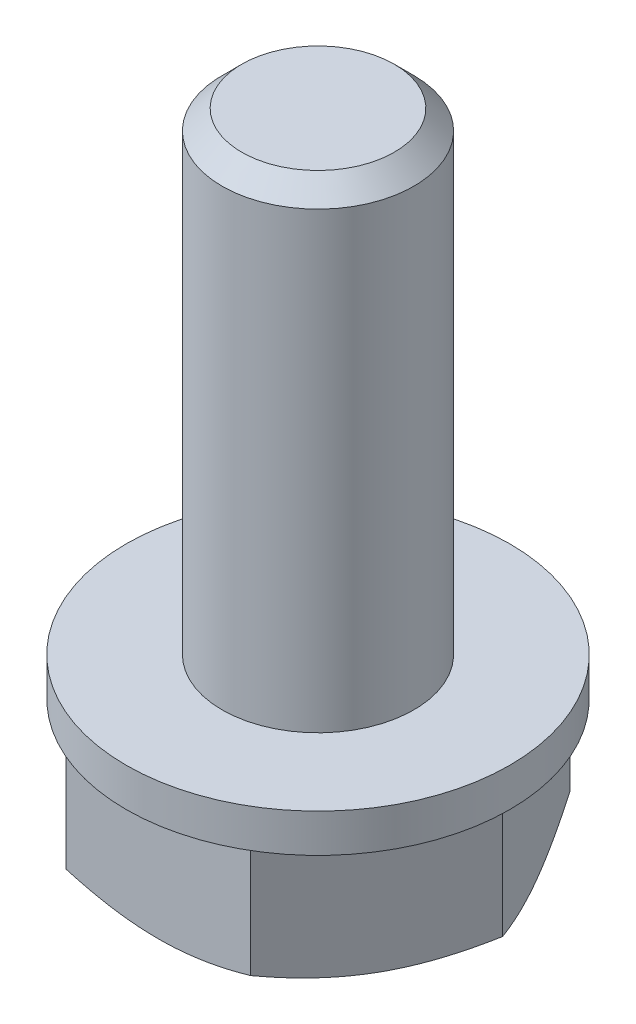
ISO-10303-21;
HEADER;
FILE_DESCRIPTION(('STEP AP214'),'2;1');
FILE_NAME('part.step','',(''),(''),'','','');
FILE_SCHEMA(('AUTOMOTIVE_DESIGN { 1 0 10303 214 1 1 1 1 }'));
ENDSEC;
DATA;
#1=APPLICATION_CONTEXT('core data for automotive mechanical design processes');
#2=APPLICATION_PROTOCOL_DEFINITION('international standard','automotive_design',2000,#1);
#3=PRODUCT_CONTEXT('',#1,'mechanical');
#4=PRODUCT('Part','Part','',(#3));
#5=PRODUCT_RELATED_PRODUCT_CATEGORY('part','',(#4));
#6=PRODUCT_DEFINITION_FORMATION('','',#4);
#7=PRODUCT_DEFINITION_CONTEXT('part definition',#1,'design');
#8=PRODUCT_DEFINITION('design','',#6,#7);
#9=PRODUCT_DEFINITION_SHAPE('','',#8);
#10=(LENGTH_UNIT() NAMED_UNIT(*) SI_UNIT(.MILLI.,.METRE.));
#11=(NAMED_UNIT(*) PLANE_ANGLE_UNIT() SI_UNIT($,.RADIAN.));
#12=(NAMED_UNIT(*) SI_UNIT($,.STERADIAN.) SOLID_ANGLE_UNIT());
#13=UNCERTAINTY_MEASURE_WITH_UNIT(LENGTH_MEASURE(1.E-05),#10,'distance_accuracy_value','');
#14=(GEOMETRIC_REPRESENTATION_CONTEXT(3) GLOBAL_UNCERTAINTY_ASSIGNED_CONTEXT((#13)) GLOBAL_UNIT_ASSIGNED_CONTEXT((#10,
#11,#12)) REPRESENTATION_CONTEXT('',''));
#15=CARTESIAN_POINT('',(0.,0.,0.));
#16=DIRECTION('',(0.,0.,1.));
#17=DIRECTION('',(1.,0.,0.));
#18=AXIS2_PLACEMENT_3D('',#15,#16,#17);
#19=CARTESIAN_POINT('',(-17.677669529664,-54.8,-20.177669529664));
#20=DIRECTION('',(0.,-1.,0.));
#21=DIRECTION('',(0.,0.,-1.));
#22=AXIS2_PLACEMENT_3D('',#19,#20,#21);
#23=PLANE('',#22);
#24=CARTESIAN_POINT('',(-17.677669529664,-54.8,-17.677669529664));
#25=DIRECTION('',(0.,-1.,0.));
#26=DIRECTION('',(0.,0.,-1.));
#27=AXIS2_PLACEMENT_3D('',#24,#25,#26);
#28=CIRCLE('',#27,5.);
#29=CARTESIAN_POINT('',(-17.677669529664,-54.8,-22.677669529664));
#30=VERTEX_POINT('',#29);
#31=CARTESIAN_POINT('',(-13.3475425107418,-54.8,-20.1776695296641));
#32=VERTEX_POINT('',#31);
#33=EDGE_CURVE('E100',#30,#32,#28,.T.);
#34=ORIENTED_EDGE('',*,*,#33,.T.);
#35=CARTESIAN_POINT('',(-17.677669529664,-54.8,-17.677669529664));
#36=DIRECTION('',(0.,-1.,0.));
#37=DIRECTION('',(0.,0.,-1.));
#38=AXIS2_PLACEMENT_3D('',#35,#36,#37);
#39=CIRCLE('',#38,5.);
#40=CARTESIAN_POINT('',(-13.3475425107418,-54.8,-15.1776695296639));
#41=VERTEX_POINT('',#40);
#42=EDGE_CURVE('E67',#32,#41,#39,.T.);
#43=ORIENTED_EDGE('',*,*,#42,.T.);
#44=CARTESIAN_POINT('',(-17.677669529664,-54.8,-17.677669529664));
#45=DIRECTION('',(0.,-1.,0.));
#46=DIRECTION('',(0.,0.,-1.));
#47=AXIS2_PLACEMENT_3D('',#44,#45,#46);
#48=CIRCLE('',#47,5.);
#49=CARTESIAN_POINT('',(-17.677669529664,-54.8,-12.677669529664));
#50=VERTEX_POINT('',#49);
#51=EDGE_CURVE('E171',#41,#50,#48,.T.);
#52=ORIENTED_EDGE('',*,*,#51,.T.);
#53=CARTESIAN_POINT('',(-17.677669529664,-54.8,-17.677669529664));
#54=DIRECTION('',(0.,-1.,0.));
#55=DIRECTION('',(0.,0.,-1.));
#56=AXIS2_PLACEMENT_3D('',#53,#54,#55);
#57=CIRCLE('',#56,5.);
#58=CARTESIAN_POINT('',(-22.0077965485861,-54.8,-15.1776695296639));
#59=VERTEX_POINT('',#58);
#60=EDGE_CURVE('E191',#50,#59,#57,.T.);
#61=ORIENTED_EDGE('',*,*,#60,.T.);
#62=CARTESIAN_POINT('',(-17.677669529664,-54.8,-17.677669529664));
#63=DIRECTION('',(0.,-1.,0.));
#64=DIRECTION('',(0.,0.,-1.));
#65=AXIS2_PLACEMENT_3D('',#62,#63,#64);
#66=CIRCLE('',#65,5.);
#67=CARTESIAN_POINT('',(-22.0077965485861,-54.8,-20.1776695296641));
#68=VERTEX_POINT('',#67);
#69=EDGE_CURVE('E120',#59,#68,#66,.T.);
#70=ORIENTED_EDGE('',*,*,#69,.T.);
#71=CARTESIAN_POINT('',(-17.677669529664,-54.8,-17.677669529664));
#72=DIRECTION('',(0.,-1.,0.));
#73=DIRECTION('',(0.,0.,-1.));
#74=AXIS2_PLACEMENT_3D('',#71,#72,#73);
#75=CIRCLE('',#74,5.);
#76=EDGE_CURVE('E108',#68,#30,#75,.T.);
#77=ORIENTED_EDGE('',*,*,#76,.T.);
#78=EDGE_LOOP('',(#34,#43,#52,#61,#70,#77));
#79=FACE_BOUND('',#78,.T.);
#80=ADVANCED_FACE('F16',(#79),#23,.T.);
#81=CARTESIAN_POINT('',(-17.677669529664,-51.9113248654052,-17.677669529664));
#82=DIRECTION('',(0.,1.,0.));
#83=DIRECTION('',(0.,0.,-1.));
#84=AXIS2_PLACEMENT_3D('',#81,#82,#83);
#85=CYLINDRICAL_SURFACE('',#84,6.);
#86=CARTESIAN_POINT('',(-17.677669529664,-49.6,-17.677669529664));
#87=DIRECTION('',(0.,-1.,0.));
#88=DIRECTION('',(0.,0.,-1.));
#89=AXIS2_PLACEMENT_3D('',#86,#87,#88);
#90=CIRCLE('',#89,6.);
#91=CARTESIAN_POINT('',(-17.677669529664,-49.6,-23.677669529664));
#92=VERTEX_POINT('',#91);
#93=EDGE_CURVE('E11',#92,#92,#90,.T.);
#94=ORIENTED_EDGE('',*,*,#93,.T.);
#95=EDGE_LOOP('',(#94));
#96=FACE_BOUND('',#95,.T.);
#97=CARTESIAN_POINT('',(-17.677669529664,-50.8,-17.677669529664));
#98=DIRECTION('',(0.,1.,0.));
#99=DIRECTION('',(0.,0.,-1.));
#100=AXIS2_PLACEMENT_3D('',#97,#98,#99);
#101=CIRCLE('',#100,6.);
#102=CARTESIAN_POINT('',(-17.677669529664,-50.8,-23.677669529664));
#103=VERTEX_POINT('',#102);
#104=EDGE_CURVE('E172',#103,#103,#101,.T.);
#105=ORIENTED_EDGE('',*,*,#104,.T.);
#106=EDGE_LOOP('',(#105));
#107=FACE_BOUND('',#106,.T.);
#108=ADVANCED_FACE('F293',(#96,#107),#85,.T.);
#109=CARTESIAN_POINT('',(-17.677669529664,-49.6,-22.177669529664));
#110=DIRECTION('',(0.,1.,0.));
#111=DIRECTION('',(0.,0.,1.));
#112=AXIS2_PLACEMENT_3D('',#109,#110,#111);
#113=PLANE('',#112);
#114=CARTESIAN_POINT('',(-17.677669529664,-49.6,-17.677669529664));
#115=DIRECTION('',(0.,-1.,0.));
#116=DIRECTION('',(0.,0.,-1.));
#117=AXIS2_PLACEMENT_3D('',#114,#115,#116);
#118=CIRCLE('',#117,3.);
#119=CARTESIAN_POINT('',(-17.677669529664,-49.6,-20.677669529664));
#120=VERTEX_POINT('',#119);
#121=EDGE_CURVE('E26',#120,#120,#118,.T.);
#122=ORIENTED_EDGE('',*,*,#121,.T.);
#123=EDGE_LOOP('',(#122));
#124=FACE_BOUND('',#123,.T.);
#125=ORIENTED_EDGE('',*,*,#93,.F.);
#126=EDGE_LOOP('',(#125));
#127=FACE_BOUND('',#126,.T.);
#128=ADVANCED_FACE('F298',(#124,#127),#113,.T.);
#129=CARTESIAN_POINT('',(-17.677669529664,-42.50675,-17.677669529664));
#130=DIRECTION('',(0.,1.,0.));
#131=DIRECTION('',(0.,0.,-1.));
#132=AXIS2_PLACEMENT_3D('',#129,#130,#131);
#133=CYLINDRICAL_SURFACE('',#132,3.);
#134=CARTESIAN_POINT('',(-17.677669529664,-35.4135,-17.677669529664));
#135=DIRECTION('',(0.,-1.,0.));
#136=DIRECTION('',(0.,0.,-1.));
#137=AXIS2_PLACEMENT_3D('',#134,#135,#136);
#138=CIRCLE('',#137,3.);
#139=CARTESIAN_POINT('',(-17.677669529664,-35.4135,-20.677669529664));
#140=VERTEX_POINT('',#139);
#141=EDGE_CURVE('E193',#140,#140,#138,.T.);
#142=ORIENTED_EDGE('',*,*,#141,.T.);
#143=EDGE_LOOP('',(#142));
#144=FACE_BOUND('',#143,.T.);
#145=ORIENTED_EDGE('',*,*,#121,.F.);
#146=EDGE_LOOP('',(#145));
#147=FACE_BOUND('',#146,.T.);
#148=ADVANCED_FACE('F319',(#144,#147),#133,.T.);
#149=CARTESIAN_POINT('',(-17.677669529664,-35.10675,-17.677669529664));
#150=DIRECTION('',(0.,-1.,0.));
#151=DIRECTION('',(0.,0.,-1.));
#152=AXIS2_PLACEMENT_3D('',#149,#150,#151);
#153=CONICAL_SURFACE('',#152,2.69325,0.785398163397448);
#154=CARTESIAN_POINT('',(-17.677669529664,-34.8,-17.677669529664));
#155=DIRECTION('',(0.,-1.,0.));
#156=DIRECTION('',(0.,0.,-1.));
#157=AXIS2_PLACEMENT_3D('',#154,#155,#156);
#158=CIRCLE('',#157,2.3865);
#159=CARTESIAN_POINT('',(-17.677669529664,-34.8,-20.064169529664));
#160=VERTEX_POINT('',#159);
#161=EDGE_CURVE('E20',#160,#160,#158,.T.);
#162=ORIENTED_EDGE('',*,*,#161,.T.);
#163=EDGE_LOOP('',(#162));
#164=FACE_BOUND('',#163,.T.);
#165=ORIENTED_EDGE('',*,*,#141,.F.);
#166=EDGE_LOOP('',(#165));
#167=FACE_BOUND('',#166,.T.);
#168=ADVANCED_FACE('F316',(#164,#167),#153,.T.);
#169=CARTESIAN_POINT('',(-17.677669529664,-34.8,-18.870919529664));
#170=DIRECTION('',(0.,1.,0.));
#171=DIRECTION('',(0.,0.,1.));
#172=AXIS2_PLACEMENT_3D('',#169,#170,#171);
#173=PLANE('',#172);
#174=ORIENTED_EDGE('',*,*,#161,.F.);
#175=EDGE_LOOP('',(#174));
#176=FACE_BOUND('',#175,.T.);
#177=ADVANCED_FACE('F310',(#176),#173,.T.);
#178=CARTESIAN_POINT('',(-17.677669529664,-54.5113248654052,-17.677669529664));
#179=DIRECTION('',(0.,1.,0.));
#180=DIRECTION('',(0.,0.,-1.));
#181=AXIS2_PLACEMENT_3D('',#178,#179,#180);
#182=CONICAL_SURFACE('',#181,5.5,1.04719755119662);
#183=CARTESIAN_POINT('',(-17.677669529664,-54.8,-12.677669529664));
#184=CARTESIAN_POINT('',(-19.0174154918196,-54.8,-12.677669529664));
#185=CARTESIAN_POINT('',(-20.5644208756121,-54.3534180126148,-12.677669529664));
#186=(BOUNDED_CURVE() B_SPLINE_CURVE(2,(#183,#184,#185),.UNSPECIFIED.,.F.,
.F.) B_SPLINE_CURVE_WITH_KNOTS((3,3),(3.37692975540509,6.36174641112158),
.UNSPECIFIED.) CURVE() GEOMETRIC_REPRESENTATION_ITEM() RATIONAL_B_SPLINE_CURVE((1.,
1.04314139574021,1.01001874935746)) REPRESENTATION_ITEM(''));
#187=CARTESIAN_POINT('',(-20.5644208756121,-54.3534180126148,-12.677669529664));
#188=VERTEX_POINT('',#187);
#189=EDGE_CURVE('E147',#50,#188,#186,.T.);
#190=ORIENTED_EDGE('',*,*,#189,.T.);
#191=CARTESIAN_POINT('',(-20.5644208756121,-54.3534180126148,-12.677669529664));
#192=CARTESIAN_POINT('',(-21.3379235675084,-54.8,-14.0174154918196));
#193=CARTESIAN_POINT('',(-22.0077965485861,-54.8,-15.1776695296639));
#194=(BOUNDED_CURVE() B_SPLINE_CURVE(2,(#191,#192,#193),.UNSPECIFIED.,.F.,
.F.) B_SPLINE_CURVE_WITH_KNOTS((3,3),(0.392113099688607,3.37692975540508),
.UNSPECIFIED.) CURVE() GEOMETRIC_REPRESENTATION_ITEM() RATIONAL_B_SPLINE_CURVE((1.01001874935746,
1.04314139574019,1.)) REPRESENTATION_ITEM(''));
#195=EDGE_CURVE('E123',#188,#59,#194,.T.);
#196=ORIENTED_EDGE('',*,*,#195,.T.);
#197=ORIENTED_EDGE('',*,*,#60,.F.);
#198=EDGE_LOOP('',(#190,#196,#197));
#199=FACE_BOUND('',#198,.T.);
#200=ADVANCED_FACE('F306',(#199),#182,.T.);
#201=CARTESIAN_POINT('',(-17.677669529664,-54.5113248654052,-17.677669529664));
#202=DIRECTION('',(0.,1.,0.));
#203=DIRECTION('',(0.,0.,-1.));
#204=AXIS2_PLACEMENT_3D('',#201,#202,#203);
#205=CONICAL_SURFACE('',#204,5.5,1.04719755119662);
#206=CARTESIAN_POINT('',(-13.3475425107418,-54.8,-15.1776695296639));
#207=CARTESIAN_POINT('',(-14.0174154918197,-54.8000000000001,-14.0174154918196));
#208=CARTESIAN_POINT('',(-14.7909181837159,-54.3534180126148,-12.677669529664));
#209=(BOUNDED_CURVE() B_SPLINE_CURVE(2,(#206,#207,#208),.UNSPECIFIED.,.F.,
.F.) B_SPLINE_CURVE_WITH_KNOTS((3,3),(3.37692975540508,6.36174641112157),
.UNSPECIFIED.) CURVE() GEOMETRIC_REPRESENTATION_ITEM() RATIONAL_B_SPLINE_CURVE((1.,
1.0431413957402,1.01001874935746)) REPRESENTATION_ITEM(''));
#210=CARTESIAN_POINT('',(-14.7909181837159,-54.3534180126148,-12.677669529664));
#211=VERTEX_POINT('',#210);
#212=EDGE_CURVE('E152',#41,#211,#209,.T.);
#213=ORIENTED_EDGE('',*,*,#212,.T.);
#214=CARTESIAN_POINT('',(-14.7909181837159,-54.3534180126148,-12.677669529664));
#215=CARTESIAN_POINT('',(-16.3379235675084,-54.8,-12.677669529664));
#216=CARTESIAN_POINT('',(-17.677669529664,-54.8,-12.677669529664));
#217=(BOUNDED_CURVE() B_SPLINE_CURVE(2,(#214,#215,#216),.UNSPECIFIED.,.F.,
.F.) B_SPLINE_CURVE_WITH_KNOTS((3,3),(0.392113099688602,3.37692975540509),
.UNSPECIFIED.) CURVE() GEOMETRIC_REPRESENTATION_ITEM() RATIONAL_B_SPLINE_CURVE((1.01001874935746,
1.04314139574021,1.)) REPRESENTATION_ITEM(''));
#218=EDGE_CURVE('E166',#211,#50,#217,.T.);
#219=ORIENTED_EDGE('',*,*,#218,.T.);
#220=ORIENTED_EDGE('',*,*,#51,.F.);
#221=EDGE_LOOP('',(#213,#219,#220));
#222=FACE_BOUND('',#221,.T.);
#223=ADVANCED_FACE('F303',(#222),#205,.T.);
#224=CARTESIAN_POINT('',(-17.677669529664,-54.5113248654052,-17.677669529664));
#225=DIRECTION('',(0.,1.,0.));
#226=DIRECTION('',(0.,0.,-1.));
#227=AXIS2_PLACEMENT_3D('',#224,#225,#226);
#228=CONICAL_SURFACE('',#227,5.5,1.04719755119662);
#229=CARTESIAN_POINT('',(-13.3475425107418,-54.8,-20.1776695296641));
#230=CARTESIAN_POINT('',(-12.677669529664,-54.8,-19.0174154918197));
#231=CARTESIAN_POINT('',(-11.9041668377677,-54.3534180126148,-17.677669529664));
#232=(BOUNDED_CURVE() B_SPLINE_CURVE(2,(#229,#230,#231),.UNSPECIFIED.,.F.,
.F.) B_SPLINE_CURVE_WITH_KNOTS((3,3),(3.37692975540508,6.36174641112167),
.UNSPECIFIED.) CURVE() GEOMETRIC_REPRESENTATION_ITEM() RATIONAL_B_SPLINE_CURVE((1.,
1.04314139574019,1.01001874935746)) REPRESENTATION_ITEM(''));
#233=CARTESIAN_POINT('',(-11.9041668377677,-54.3534180126148,-17.677669529664));
#234=VERTEX_POINT('',#233);
#235=EDGE_CURVE('E158',#32,#234,#232,.T.);
#236=ORIENTED_EDGE('',*,*,#235,.T.);
#237=CARTESIAN_POINT('',(-11.9041668377677,-54.3534180126148,-17.677669529664));
#238=CARTESIAN_POINT('',(-12.677669529664,-54.8,-16.3379235675083));
#239=CARTESIAN_POINT('',(-13.3475425107418,-54.8,-15.1776695296639));
#240=(BOUNDED_CURVE() B_SPLINE_CURVE(2,(#237,#238,#239),.UNSPECIFIED.,.F.,
.F.) B_SPLINE_CURVE_WITH_KNOTS((3,3),(0.392113099688502,3.37692975540508),
.UNSPECIFIED.) CURVE() GEOMETRIC_REPRESENTATION_ITEM() RATIONAL_B_SPLINE_CURVE((1.01001874935746,
1.04314139574019,1.)) REPRESENTATION_ITEM(''));
#241=EDGE_CURVE('E154',#234,#41,#240,.T.);
#242=ORIENTED_EDGE('',*,*,#241,.T.);
#243=ORIENTED_EDGE('',*,*,#42,.F.);
#244=EDGE_LOOP('',(#236,#242,#243));
#245=FACE_BOUND('',#244,.T.);
#246=ADVANCED_FACE('F288',(#245),#228,.T.);
#247=CARTESIAN_POINT('',(-17.677669529664,-54.5113248654052,-17.677669529664));
#248=DIRECTION('',(0.,1.,0.));
#249=DIRECTION('',(0.,0.,-1.));
#250=AXIS2_PLACEMENT_3D('',#247,#248,#249);
#251=CONICAL_SURFACE('',#250,5.5,1.04719755119662);
#252=CARTESIAN_POINT('',(-14.7909181837159,-54.3534180126148,-22.677669529664));
#253=CARTESIAN_POINT('',(-14.0174154918196,-54.8,-21.3379235675084));
#254=CARTESIAN_POINT('',(-13.3475425107418,-54.8,-20.1776695296641));
#255=(BOUNDED_CURVE() B_SPLINE_CURVE(2,(#252,#253,#254),.UNSPECIFIED.,.F.,
.F.) B_SPLINE_CURVE_WITH_KNOTS((3,3),(0.392113099688607,3.37692975540508),
.UNSPECIFIED.) CURVE() GEOMETRIC_REPRESENTATION_ITEM() RATIONAL_B_SPLINE_CURVE((1.01001874935746,
1.04314139574019,1.)) REPRESENTATION_ITEM(''));
#256=CARTESIAN_POINT('',(-14.7909181837159,-54.3534180126148,-22.677669529664));
#257=VERTEX_POINT('',#256);
#258=EDGE_CURVE('E215',#257,#32,#255,.T.);
#259=ORIENTED_EDGE('',*,*,#258,.T.);
#260=ORIENTED_EDGE('',*,*,#33,.F.);
#261=CARTESIAN_POINT('',(-17.677669529664,-54.8,-22.677669529664));
#262=CARTESIAN_POINT('',(-16.3379235675084,-54.8,-22.677669529664));
#263=CARTESIAN_POINT('',(-14.7909181837159,-54.3534180126148,-22.677669529664));
#264=(BOUNDED_CURVE() B_SPLINE_CURVE(2,(#261,#262,#263),.UNSPECIFIED.,.F.,
.F.) B_SPLINE_CURVE_WITH_KNOTS((3,3),(3.37692975540509,6.36174641112158),
.UNSPECIFIED.) CURVE() GEOMETRIC_REPRESENTATION_ITEM() RATIONAL_B_SPLINE_CURVE((1.,
1.04314139574021,1.01001874935746)) REPRESENTATION_ITEM(''));
#265=EDGE_CURVE('E78',#30,#257,#264,.T.);
#266=ORIENTED_EDGE('',*,*,#265,.T.);
#267=EDGE_LOOP('',(#259,#260,#266));
#268=FACE_BOUND('',#267,.T.);
#269=ADVANCED_FACE('F280',(#268),#251,.T.);
#270=CARTESIAN_POINT('',(-17.677669529664,-54.5113248654052,-17.677669529664));
#271=DIRECTION('',(0.,1.,0.));
#272=DIRECTION('',(0.,0.,-1.));
#273=AXIS2_PLACEMENT_3D('',#270,#271,#272);
#274=CONICAL_SURFACE('',#273,5.5,1.04719755119662);
#275=CARTESIAN_POINT('',(-20.5644208756121,-54.3534180126148,-22.677669529664));
#276=CARTESIAN_POINT('',(-19.0174154918196,-54.8,-22.677669529664));
#277=CARTESIAN_POINT('',(-17.677669529664,-54.8,-22.677669529664));
#278=(BOUNDED_CURVE() B_SPLINE_CURVE(2,(#275,#276,#277),.UNSPECIFIED.,.F.,
.F.) B_SPLINE_CURVE_WITH_KNOTS((3,3),(0.392113099688602,3.37692975540509),
.UNSPECIFIED.) CURVE() GEOMETRIC_REPRESENTATION_ITEM() RATIONAL_B_SPLINE_CURVE((1.01001874935746,
1.04314139574021,1.)) REPRESENTATION_ITEM(''));
#279=CARTESIAN_POINT('',(-20.5644208756121,-54.3534180126148,-22.677669529664));
#280=VERTEX_POINT('',#279);
#281=EDGE_CURVE('E196',#280,#30,#278,.T.);
#282=ORIENTED_EDGE('',*,*,#281,.T.);
#283=ORIENTED_EDGE('',*,*,#76,.F.);
#284=CARTESIAN_POINT('',(-22.0077965485861,-54.8,-20.1776695296641));
#285=CARTESIAN_POINT('',(-21.3379235675084,-54.8000000000001,-21.3379235675084));
#286=CARTESIAN_POINT('',(-20.5644208756121,-54.3534180126148,-22.677669529664));
#287=(BOUNDED_CURVE() B_SPLINE_CURVE(2,(#284,#285,#286),.UNSPECIFIED.,.F.,
.F.) B_SPLINE_CURVE_WITH_KNOTS((3,3),(3.37692975540508,6.36174641112157),
.UNSPECIFIED.) CURVE() GEOMETRIC_REPRESENTATION_ITEM() RATIONAL_B_SPLINE_CURVE((1.,
1.0431413957402,1.01001874935746)) REPRESENTATION_ITEM(''));
#288=EDGE_CURVE('E97',#68,#280,#287,.T.);
#289=ORIENTED_EDGE('',*,*,#288,.T.);
#290=EDGE_LOOP('',(#282,#283,#289));
#291=FACE_BOUND('',#290,.T.);
#292=ADVANCED_FACE('F278',(#291),#274,.T.);
#293=CARTESIAN_POINT('',(-17.677669529664,-54.5113248654052,-17.677669529664));
#294=DIRECTION('',(0.,1.,0.));
#295=DIRECTION('',(0.,0.,-1.));
#296=AXIS2_PLACEMENT_3D('',#293,#294,#295);
#297=CONICAL_SURFACE('',#296,5.5,1.04719755119662);
#298=CARTESIAN_POINT('',(-23.4511722215603,-54.3534180126148,-17.677669529664));
#299=CARTESIAN_POINT('',(-22.677669529664,-54.8,-19.0174154918197));
#300=CARTESIAN_POINT('',(-22.0077965485861,-54.8,-20.1776695296641));
#301=(BOUNDED_CURVE() B_SPLINE_CURVE(2,(#298,#299,#300),.UNSPECIFIED.,.F.,
.F.) B_SPLINE_CURVE_WITH_KNOTS((3,3),(0.392113099688502,3.37692975540508),
.UNSPECIFIED.) CURVE() GEOMETRIC_REPRESENTATION_ITEM() RATIONAL_B_SPLINE_CURVE((1.01001874935746,
1.04314139574019,1.)) REPRESENTATION_ITEM(''));
#302=CARTESIAN_POINT('',(-23.4511722215603,-54.3534180126148,-17.677669529664));
#303=VERTEX_POINT('',#302);
#304=EDGE_CURVE('E119',#303,#68,#301,.T.);
#305=ORIENTED_EDGE('',*,*,#304,.T.);
#306=ORIENTED_EDGE('',*,*,#69,.F.);
#307=CARTESIAN_POINT('',(-22.0077965485861,-54.8,-15.1776695296639));
#308=CARTESIAN_POINT('',(-22.677669529664,-54.8,-16.3379235675084));
#309=CARTESIAN_POINT('',(-23.4511722215603,-54.3534180126148,-17.677669529664));
#310=(BOUNDED_CURVE() B_SPLINE_CURVE(2,(#307,#308,#309),.UNSPECIFIED.,.F.,
.F.) B_SPLINE_CURVE_WITH_KNOTS((3,3),(3.37692975540508,6.36174641112167),
.UNSPECIFIED.) CURVE() GEOMETRIC_REPRESENTATION_ITEM() RATIONAL_B_SPLINE_CURVE((1.,
1.04314139574019,1.01001874935746)) REPRESENTATION_ITEM(''));
#311=EDGE_CURVE('E115',#59,#303,#310,.T.);
#312=ORIENTED_EDGE('',*,*,#311,.T.);
#313=EDGE_LOOP('',(#305,#306,#312));
#314=FACE_BOUND('',#313,.T.);
#315=ADVANCED_FACE('F117',(#314),#297,.T.);
#316=CARTESIAN_POINT('',(-17.677669529664,-50.8,-17.677669529664));
#317=DIRECTION('',(0.,-1.,0.));
#318=DIRECTION('',(-1.,0.,0.));
#319=AXIS2_PLACEMENT_3D('',#316,#317,#318);
#320=PLANE('',#319);
#321=DIRECTION('',(0.500000000000009,0.,-0.866025403784433));
#322=VECTOR('',#321,1.);
#323=CARTESIAN_POINT('',(-11.9041668377677,-50.8,-17.677669529664));
#324=LINE('',#323,#322);
#325=CARTESIAN_POINT('',(-14.7909181837159,-50.8,-12.677669529664));
#326=VERTEX_POINT('',#325);
#327=CARTESIAN_POINT('',(-11.9041668377677,-50.8,-17.677669529664));
#328=VERTEX_POINT('',#327);
#329=EDGE_CURVE('E153',#326,#328,#324,.T.);
#330=ORIENTED_EDGE('',*,*,#329,.T.);
#331=DIRECTION('',(-0.500000000000009,0.,-0.866025403784433));
#332=VECTOR('',#331,1.);
#333=CARTESIAN_POINT('',(-14.7909181837159,-50.8,-22.677669529664));
#334=LINE('',#333,#332);
#335=CARTESIAN_POINT('',(-14.7909181837159,-50.8,-22.677669529664));
#336=VERTEX_POINT('',#335);
#337=EDGE_CURVE('E213',#328,#336,#334,.T.);
#338=ORIENTED_EDGE('',*,*,#337,.T.);
#339=DIRECTION('',(-1.,0.,0.));
#340=VECTOR('',#339,1.);
#341=CARTESIAN_POINT('',(-20.5644208756121,-50.8,-22.677669529664));
#342=LINE('',#341,#340);
#343=CARTESIAN_POINT('',(-20.5644208756121,-50.8,-22.677669529664));
#344=VERTEX_POINT('',#343);
#345=EDGE_CURVE('E136',#336,#344,#342,.T.);
#346=ORIENTED_EDGE('',*,*,#345,.T.);
#347=DIRECTION('',(-0.500000000000009,0.,0.866025403784433));
#348=VECTOR('',#347,1.);
#349=CARTESIAN_POINT('',(-23.4511722215603,-50.8,-17.677669529664));
#350=LINE('',#349,#348);
#351=CARTESIAN_POINT('',(-23.4511722215603,-50.8,-17.677669529664));
#352=VERTEX_POINT('',#351);
#353=EDGE_CURVE('E124',#344,#352,#350,.T.);
#354=ORIENTED_EDGE('',*,*,#353,.T.);
#355=DIRECTION('',(0.500000000000009,0.,0.866025403784433));
#356=VECTOR('',#355,1.);
#357=CARTESIAN_POINT('',(-20.5644208756121,-50.8,-12.677669529664));
#358=LINE('',#357,#356);
#359=CARTESIAN_POINT('',(-20.5644208756121,-50.8,-12.677669529664));
#360=VERTEX_POINT('',#359);
#361=EDGE_CURVE('E130',#352,#360,#358,.T.);
#362=ORIENTED_EDGE('',*,*,#361,.T.);
#363=DIRECTION('',(1.,0.,0.));
#364=VECTOR('',#363,1.);
#365=CARTESIAN_POINT('',(-14.7909181837159,-50.8,-12.677669529664));
#366=LINE('',#365,#364);
#367=EDGE_CURVE('E148',#360,#326,#366,.T.);
#368=ORIENTED_EDGE('',*,*,#367,.T.);
#369=EDGE_LOOP('',(#330,#338,#346,#354,#362,#368));
#370=FACE_BOUND('',#369,.T.);
#371=ORIENTED_EDGE('',*,*,#104,.F.);
#372=EDGE_LOOP('',(#371));
#373=FACE_BOUND('',#372,.T.);
#374=ADVANCED_FACE('F256',(#370,#373),#320,.T.);
#375=CARTESIAN_POINT('',(-23.4511722215603,-54.8,-17.677669529664));
#376=DIRECTION('',(0.866025403784433,0.,-0.500000000000009));
#377=DIRECTION('',(-0.500000000000009,0.,-0.866025403784433));
#378=AXIS2_PLACEMENT_3D('',#375,#376,#377);
#379=PLANE('',#378);
#380=ORIENTED_EDGE('',*,*,#311,.F.);
#381=ORIENTED_EDGE('',*,*,#195,.F.);
#382=DIRECTION('',(0.,1.,0.));
#383=VECTOR('',#382,1.);
#384=CARTESIAN_POINT('',(-20.5644208756121,-54.8,-12.677669529664));
#385=LINE('',#384,#383);
#386=EDGE_CURVE('E142',#188,#360,#385,.T.);
#387=ORIENTED_EDGE('',*,*,#386,.T.);
#388=ORIENTED_EDGE('',*,*,#361,.F.);
#389=DIRECTION('',(0.,1.,0.));
#390=VECTOR('',#389,1.);
#391=CARTESIAN_POINT('',(-23.4511722215603,-54.8,-17.677669529664));
#392=LINE('',#391,#390);
#393=EDGE_CURVE('E127',#303,#352,#392,.T.);
#394=ORIENTED_EDGE('',*,*,#393,.F.);
#395=EDGE_LOOP('',(#380,#381,#387,#388,#394));
#396=FACE_BOUND('',#395,.T.);
#397=ADVANCED_FACE('F128',(#396),#379,.F.);
#398=CARTESIAN_POINT('',(-20.5644208756121,-54.8,-22.677669529664));
#399=DIRECTION('',(0.866025403784433,0.,0.500000000000009));
#400=DIRECTION('',(0.500000000000009,0.,-0.866025403784433));
#401=AXIS2_PLACEMENT_3D('',#398,#399,#400);
#402=PLANE('',#401);
#403=ORIENTED_EDGE('',*,*,#288,.F.);
#404=ORIENTED_EDGE('',*,*,#304,.F.);
#405=ORIENTED_EDGE('',*,*,#393,.T.);
#406=ORIENTED_EDGE('',*,*,#353,.F.);
#407=DIRECTION('',(0.,1.,0.));
#408=VECTOR('',#407,1.);
#409=CARTESIAN_POINT('',(-20.5644208756121,-54.8,-22.677669529664));
#410=LINE('',#409,#408);
#411=EDGE_CURVE('E182',#280,#344,#410,.T.);
#412=ORIENTED_EDGE('',*,*,#411,.F.);
#413=EDGE_LOOP('',(#403,#404,#405,#406,#412));
#414=FACE_BOUND('',#413,.T.);
#415=ADVANCED_FACE('F134',(#414),#402,.F.);
#416=CARTESIAN_POINT('',(-14.7909181837159,-54.8,-22.677669529664));
#417=DIRECTION('',(0.,0.,1.));
#418=DIRECTION('',(1.,0.,0.));
#419=AXIS2_PLACEMENT_3D('',#416,#417,#418);
#420=PLANE('',#419);
#421=ORIENTED_EDGE('',*,*,#265,.F.);
#422=ORIENTED_EDGE('',*,*,#281,.F.);
#423=ORIENTED_EDGE('',*,*,#411,.T.);
#424=ORIENTED_EDGE('',*,*,#345,.F.);
#425=DIRECTION('',(0.,1.,0.));
#426=VECTOR('',#425,1.);
#427=CARTESIAN_POINT('',(-14.7909181837159,-54.8,-22.677669529664));
#428=LINE('',#427,#426);
#429=EDGE_CURVE('E219',#257,#336,#428,.T.);
#430=ORIENTED_EDGE('',*,*,#429,.F.);
#431=EDGE_LOOP('',(#421,#422,#423,#424,#430));
#432=FACE_BOUND('',#431,.T.);
#433=ADVANCED_FACE('F18',(#432),#420,.F.);
#434=CARTESIAN_POINT('',(-20.5644208756121,-54.8,-12.677669529664));
#435=DIRECTION('',(0.,0.,-1.));
#436=DIRECTION('',(-1.,0.,0.));
#437=AXIS2_PLACEMENT_3D('',#434,#435,#436);
#438=PLANE('',#437);
#439=ORIENTED_EDGE('',*,*,#218,.F.);
#440=DIRECTION('',(0.,1.,0.));
#441=VECTOR('',#440,1.);
#442=CARTESIAN_POINT('',(-14.7909181837159,-54.8,-12.677669529664));
#443=LINE('',#442,#441);
#444=EDGE_CURVE('E149',#211,#326,#443,.T.);
#445=ORIENTED_EDGE('',*,*,#444,.T.);
#446=ORIENTED_EDGE('',*,*,#367,.F.);
#447=ORIENTED_EDGE('',*,*,#386,.F.);
#448=ORIENTED_EDGE('',*,*,#189,.F.);
#449=EDGE_LOOP('',(#439,#445,#446,#447,#448));
#450=FACE_BOUND('',#449,.T.);
#451=ADVANCED_FACE('F263',(#450),#438,.F.);
#452=CARTESIAN_POINT('',(-14.7909181837159,-54.8,-12.677669529664));
#453=DIRECTION('',(-0.866025403784433,0.,-0.500000000000009));
#454=DIRECTION('',(-0.500000000000009,0.,0.866025403784433));
#455=AXIS2_PLACEMENT_3D('',#452,#453,#454);
#456=PLANE('',#455);
#457=ORIENTED_EDGE('',*,*,#241,.F.);
#458=DIRECTION('',(0.,1.,0.));
#459=VECTOR('',#458,1.);
#460=CARTESIAN_POINT('',(-11.9041668377677,-54.8,-17.677669529664));
#461=LINE('',#460,#459);
#462=EDGE_CURVE('E207',#234,#328,#461,.T.);
#463=ORIENTED_EDGE('',*,*,#462,.T.);
#464=ORIENTED_EDGE('',*,*,#329,.F.);
#465=ORIENTED_EDGE('',*,*,#444,.F.);
#466=ORIENTED_EDGE('',*,*,#212,.F.);
#467=EDGE_LOOP('',(#457,#463,#464,#465,#466));
#468=FACE_BOUND('',#467,.T.);
#469=ADVANCED_FACE('F267',(#468),#456,.F.);
#470=CARTESIAN_POINT('',(-11.9041668377677,-54.8,-17.677669529664));
#471=DIRECTION('',(-0.866025403784433,0.,0.500000000000009));
#472=DIRECTION('',(0.500000000000009,0.,0.866025403784433));
#473=AXIS2_PLACEMENT_3D('',#470,#471,#472);
#474=PLANE('',#473);
#475=ORIENTED_EDGE('',*,*,#258,.F.);
#476=ORIENTED_EDGE('',*,*,#429,.T.);
#477=ORIENTED_EDGE('',*,*,#337,.F.);
#478=ORIENTED_EDGE('',*,*,#462,.F.);
#479=ORIENTED_EDGE('',*,*,#235,.F.);
#480=EDGE_LOOP('',(#475,#476,#477,#478,#479));
#481=FACE_BOUND('',#480,.T.);
#482=ADVANCED_FACE('F274',(#481),#474,.F.);
#483=CLOSED_SHELL('',(#80,#108,#128,#148,#168,#177,#200,#223,#246,#269,#292,#315,#374,#397,#415,
#433,#451,#469,#482));
#484=MANIFOLD_SOLID_BREP('B1',#483);
#485=ADVANCED_BREP_SHAPE_REPRESENTATION('',(#18,#484),#14);
#486=SHAPE_DEFINITION_REPRESENTATION(#9,#485);
ENDSEC;
END-ISO-10303-21;
